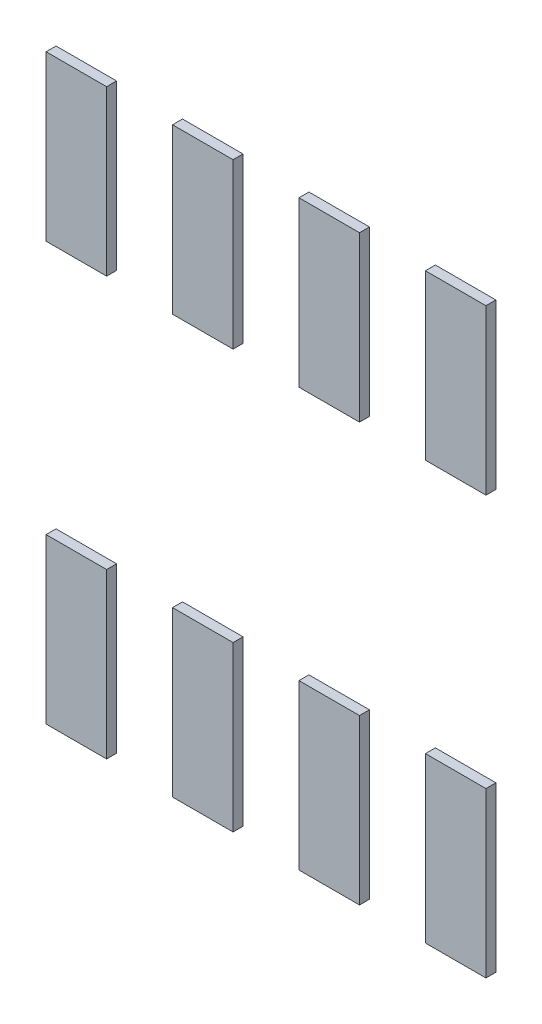
ISO-10303-21;
HEADER;
FILE_DESCRIPTION(('STEP AP214'),'2;1');
FILE_NAME('part.step','',(''),(''),'','','');
FILE_SCHEMA(('AUTOMOTIVE_DESIGN { 1 0 10303 214 1 1 1 1 }'));
ENDSEC;
DATA;
#1=APPLICATION_CONTEXT('core data for automotive mechanical design processes');
#2=APPLICATION_PROTOCOL_DEFINITION('international standard','automotive_design',2000,#1);
#3=PRODUCT_CONTEXT('',#1,'mechanical');
#4=PRODUCT('Part','Part','',(#3));
#5=PRODUCT_RELATED_PRODUCT_CATEGORY('part','',(#4));
#6=PRODUCT_DEFINITION_FORMATION('','',#4);
#7=PRODUCT_DEFINITION_CONTEXT('part definition',#1,'design');
#8=PRODUCT_DEFINITION('design','',#6,#7);
#9=PRODUCT_DEFINITION_SHAPE('','',#8);
#10=(LENGTH_UNIT() NAMED_UNIT(*) SI_UNIT(.MILLI.,.METRE.));
#11=(NAMED_UNIT(*) PLANE_ANGLE_UNIT() SI_UNIT($,.RADIAN.));
#12=(NAMED_UNIT(*) SI_UNIT($,.STERADIAN.) SOLID_ANGLE_UNIT());
#13=UNCERTAINTY_MEASURE_WITH_UNIT(LENGTH_MEASURE(1.E-05),#10,'distance_accuracy_value','');
#14=(GEOMETRIC_REPRESENTATION_CONTEXT(3) GLOBAL_UNCERTAINTY_ASSIGNED_CONTEXT((#13)) GLOBAL_UNIT_ASSIGNED_CONTEXT((#10,
#11,#12)) REPRESENTATION_CONTEXT('',''));
#15=CARTESIAN_POINT('',(0.,0.,0.));
#16=DIRECTION('',(0.,0.,1.));
#17=DIRECTION('',(1.,0.,0.));
#18=AXIS2_PLACEMENT_3D('',#15,#16,#17);
#19=CARTESIAN_POINT('',(-2.209,1.276,0.1));
#20=DIRECTION('',(0.,0.,1.));
#21=DIRECTION('',(1.,0.,0.));
#22=AXIS2_PLACEMENT_3D('',#19,#20,#21);
#23=PLANE('',#22);
#24=DIRECTION('',(0.,1.,0.));
#25=VECTOR('',#24,1.);
#26=CARTESIAN_POINT('',(-2.209,1.276,0.1));
#27=LINE('',#26,#25);
#28=CARTESIAN_POINT('',(-2.209,1.276,0.1));
#29=VERTEX_POINT('',#28);
#30=CARTESIAN_POINT('',(-2.209,2.924,0.1));
#31=VERTEX_POINT('',#30);
#32=EDGE_CURVE('P0_E88',#29,#31,#27,.T.);
#33=ORIENTED_EDGE('',*,*,#32,.F.);
#34=DIRECTION('',(1.,0.,0.));
#35=VECTOR('',#34,1.);
#36=CARTESIAN_POINT('',(-2.209,1.276,0.1));
#37=LINE('',#36,#35);
#38=CARTESIAN_POINT('',(-1.601,1.276,0.1));
#39=VERTEX_POINT('',#38);
#40=EDGE_CURVE('P0_E70',#29,#39,#37,.T.);
#41=ORIENTED_EDGE('',*,*,#40,.T.);
#42=DIRECTION('',(0.,1.,0.));
#43=VECTOR('',#42,1.);
#44=CARTESIAN_POINT('',(-1.601,1.276,0.1));
#45=LINE('',#44,#43);
#46=CARTESIAN_POINT('',(-1.601,2.924,0.1));
#47=VERTEX_POINT('',#46);
#48=EDGE_CURVE('P0_E82',#39,#47,#45,.T.);
#49=ORIENTED_EDGE('',*,*,#48,.T.);
#50=DIRECTION('',(1.,0.,0.));
#51=VECTOR('',#50,1.);
#52=CARTESIAN_POINT('',(-2.209,2.924,0.1));
#53=LINE('',#52,#51);
#54=EDGE_CURVE('P0_E11',#31,#47,#53,.T.);
#55=ORIENTED_EDGE('',*,*,#54,.F.);
#56=EDGE_LOOP('',(#33,#41,#49,#55));
#57=FACE_BOUND('',#56,.T.);
#58=ADVANCED_FACE('P0_F17',(#57),#23,.T.);
#59=CARTESIAN_POINT('',(-2.209,1.276,0.));
#60=DIRECTION('',(0.,0.,1.));
#61=DIRECTION('',(1.,0.,0.));
#62=AXIS2_PLACEMENT_3D('',#59,#60,#61);
#63=PLANE('',#62);
#64=DIRECTION('',(1.,0.,0.));
#65=VECTOR('',#64,1.);
#66=CARTESIAN_POINT('',(-2.209,2.924,0.));
#67=LINE('',#66,#65);
#68=CARTESIAN_POINT('',(-2.209,2.924,0.));
#69=VERTEX_POINT('',#68);
#70=CARTESIAN_POINT('',(-1.601,2.924,0.));
#71=VERTEX_POINT('',#70);
#72=EDGE_CURVE('P0_E25',#69,#71,#67,.T.);
#73=ORIENTED_EDGE('',*,*,#72,.T.);
#74=DIRECTION('',(0.,1.,0.));
#75=VECTOR('',#74,1.);
#76=CARTESIAN_POINT('',(-1.601,1.276,0.));
#77=LINE('',#76,#75);
#78=CARTESIAN_POINT('',(-1.601,1.276,0.));
#79=VERTEX_POINT('',#78);
#80=EDGE_CURVE('P0_E106',#79,#71,#77,.T.);
#81=ORIENTED_EDGE('',*,*,#80,.F.);
#82=DIRECTION('',(1.,0.,0.));
#83=VECTOR('',#82,1.);
#84=CARTESIAN_POINT('',(-2.209,1.276,0.));
#85=LINE('',#84,#83);
#86=CARTESIAN_POINT('',(-2.209,1.276,0.));
#87=VERTEX_POINT('',#86);
#88=EDGE_CURVE('P0_E81',#87,#79,#85,.T.);
#89=ORIENTED_EDGE('',*,*,#88,.F.);
#90=DIRECTION('',(0.,1.,0.));
#91=VECTOR('',#90,1.);
#92=CARTESIAN_POINT('',(-2.209,1.276,0.));
#93=LINE('',#92,#91);
#94=EDGE_CURVE('P0_E89',#87,#69,#93,.T.);
#95=ORIENTED_EDGE('',*,*,#94,.T.);
#96=EDGE_LOOP('',(#73,#81,#89,#95));
#97=FACE_BOUND('',#96,.T.);
#98=ADVANCED_FACE('P0_F157',(#97),#63,.F.);
#99=CARTESIAN_POINT('',(-2.209,2.924,0.));
#100=DIRECTION('',(0.,1.,0.));
#101=DIRECTION('',(1.,0.,0.));
#102=AXIS2_PLACEMENT_3D('',#99,#100,#101);
#103=PLANE('',#102);
#104=ORIENTED_EDGE('',*,*,#72,.F.);
#105=DIRECTION('',(0.,0.,1.));
#106=VECTOR('',#105,1.);
#107=CARTESIAN_POINT('',(-2.209,2.924,0.));
#108=LINE('',#107,#106);
#109=EDGE_CURVE('P0_E93',#69,#31,#108,.T.);
#110=ORIENTED_EDGE('',*,*,#109,.T.);
#111=ORIENTED_EDGE('',*,*,#54,.T.);
#112=DIRECTION('',(0.,0.,1.));
#113=VECTOR('',#112,1.);
#114=CARTESIAN_POINT('',(-1.601,2.924,0.));
#115=LINE('',#114,#113);
#116=EDGE_CURVE('P0_E102',#71,#47,#115,.T.);
#117=ORIENTED_EDGE('',*,*,#116,.F.);
#118=EDGE_LOOP('',(#104,#110,#111,#117));
#119=FACE_BOUND('',#118,.T.);
#120=ADVANCED_FACE('P0_F156',(#119),#103,.T.);
#121=CARTESIAN_POINT('',(-2.209,1.276,0.));
#122=DIRECTION('',(0.,1.,0.));
#123=DIRECTION('',(1.,0.,0.));
#124=AXIS2_PLACEMENT_3D('',#121,#122,#123);
#125=PLANE('',#124);
#126=DIRECTION('',(0.,0.,1.));
#127=VECTOR('',#126,1.);
#128=CARTESIAN_POINT('',(-1.601,1.276,0.));
#129=LINE('',#128,#127);
#130=EDGE_CURVE('P0_E76',#79,#39,#129,.T.);
#131=ORIENTED_EDGE('',*,*,#130,.T.);
#132=ORIENTED_EDGE('',*,*,#40,.F.);
#133=DIRECTION('',(0.,0.,1.));
#134=VECTOR('',#133,1.);
#135=CARTESIAN_POINT('',(-2.209,1.276,0.));
#136=LINE('',#135,#134);
#137=EDGE_CURVE('P0_E73',#87,#29,#136,.T.);
#138=ORIENTED_EDGE('',*,*,#137,.F.);
#139=ORIENTED_EDGE('',*,*,#88,.T.);
#140=EDGE_LOOP('',(#131,#132,#138,#139));
#141=FACE_BOUND('',#140,.T.);
#142=ADVANCED_FACE('P0_F72',(#141),#125,.F.);
#143=CARTESIAN_POINT('',(-1.601,1.276,0.));
#144=DIRECTION('',(1.,0.,0.));
#145=DIRECTION('',(0.,1.,0.));
#146=AXIS2_PLACEMENT_3D('',#143,#144,#145);
#147=PLANE('',#146);
#148=ORIENTED_EDGE('',*,*,#130,.F.);
#149=ORIENTED_EDGE('',*,*,#80,.T.);
#150=ORIENTED_EDGE('',*,*,#116,.T.);
#151=ORIENTED_EDGE('',*,*,#48,.F.);
#152=EDGE_LOOP('',(#148,#149,#150,#151));
#153=FACE_BOUND('',#152,.T.);
#154=ADVANCED_FACE('P0_F155',(#153),#147,.T.);
#155=CARTESIAN_POINT('',(-2.209,1.276,0.));
#156=DIRECTION('',(1.,0.,0.));
#157=DIRECTION('',(0.,1.,0.));
#158=AXIS2_PLACEMENT_3D('',#155,#156,#157);
#159=PLANE('',#158);
#160=ORIENTED_EDGE('',*,*,#32,.T.);
#161=ORIENTED_EDGE('',*,*,#109,.F.);
#162=ORIENTED_EDGE('',*,*,#94,.F.);
#163=ORIENTED_EDGE('',*,*,#137,.T.);
#164=EDGE_LOOP('',(#160,#161,#162,#163));
#165=FACE_BOUND('',#164,.T.);
#166=ADVANCED_FACE('P0_F86',(#165),#159,.F.);
#167=CLOSED_SHELL('',(#58,#98,#120,#142,#154,#166));
#168=MANIFOLD_SOLID_BREP('P0_B1',#167);
#169=CARTESIAN_POINT('',(-2.209,-2.924,0.1));
#170=DIRECTION('',(0.,0.,1.));
#171=DIRECTION('',(1.,0.,0.));
#172=AXIS2_PLACEMENT_3D('',#169,#170,#171);
#173=PLANE('',#172);
#174=DIRECTION('',(0.,1.,0.));
#175=VECTOR('',#174,1.);
#176=CARTESIAN_POINT('',(-2.209,-2.924,0.1));
#177=LINE('',#176,#175);
#178=CARTESIAN_POINT('',(-2.209,-2.924,0.1));
#179=VERTEX_POINT('',#178);
#180=CARTESIAN_POINT('',(-2.209,-1.276,0.1));
#181=VERTEX_POINT('',#180);
#182=EDGE_CURVE('P1_E88',#179,#181,#177,.T.);
#183=ORIENTED_EDGE('',*,*,#182,.F.);
#184=DIRECTION('',(1.,0.,0.));
#185=VECTOR('',#184,1.);
#186=CARTESIAN_POINT('',(-2.209,-2.924,0.1));
#187=LINE('',#186,#185);
#188=CARTESIAN_POINT('',(-1.601,-2.924,0.1));
#189=VERTEX_POINT('',#188);
#190=EDGE_CURVE('P1_E70',#179,#189,#187,.T.);
#191=ORIENTED_EDGE('',*,*,#190,.T.);
#192=DIRECTION('',(0.,1.,0.));
#193=VECTOR('',#192,1.);
#194=CARTESIAN_POINT('',(-1.601,-2.924,0.1));
#195=LINE('',#194,#193);
#196=CARTESIAN_POINT('',(-1.601,-1.276,0.1));
#197=VERTEX_POINT('',#196);
#198=EDGE_CURVE('P1_E82',#189,#197,#195,.T.);
#199=ORIENTED_EDGE('',*,*,#198,.T.);
#200=DIRECTION('',(1.,0.,0.));
#201=VECTOR('',#200,1.);
#202=CARTESIAN_POINT('',(-2.209,-1.276,0.1));
#203=LINE('',#202,#201);
#204=EDGE_CURVE('P1_E11',#181,#197,#203,.T.);
#205=ORIENTED_EDGE('',*,*,#204,.F.);
#206=EDGE_LOOP('',(#183,#191,#199,#205));
#207=FACE_BOUND('',#206,.T.);
#208=ADVANCED_FACE('P1_F17',(#207),#173,.T.);
#209=CARTESIAN_POINT('',(-2.209,-2.924,0.));
#210=DIRECTION('',(0.,0.,1.));
#211=DIRECTION('',(1.,0.,0.));
#212=AXIS2_PLACEMENT_3D('',#209,#210,#211);
#213=PLANE('',#212);
#214=DIRECTION('',(1.,0.,0.));
#215=VECTOR('',#214,1.);
#216=CARTESIAN_POINT('',(-2.209,-1.276,0.));
#217=LINE('',#216,#215);
#218=CARTESIAN_POINT('',(-2.209,-1.276,0.));
#219=VERTEX_POINT('',#218);
#220=CARTESIAN_POINT('',(-1.601,-1.276,0.));
#221=VERTEX_POINT('',#220);
#222=EDGE_CURVE('P1_E25',#219,#221,#217,.T.);
#223=ORIENTED_EDGE('',*,*,#222,.T.);
#224=DIRECTION('',(0.,1.,0.));
#225=VECTOR('',#224,1.);
#226=CARTESIAN_POINT('',(-1.601,-2.924,0.));
#227=LINE('',#226,#225);
#228=CARTESIAN_POINT('',(-1.601,-2.924,0.));
#229=VERTEX_POINT('',#228);
#230=EDGE_CURVE('P1_E105',#229,#221,#227,.T.);
#231=ORIENTED_EDGE('',*,*,#230,.F.);
#232=DIRECTION('',(1.,0.,0.));
#233=VECTOR('',#232,1.);
#234=CARTESIAN_POINT('',(-2.209,-2.924,0.));
#235=LINE('',#234,#233);
#236=CARTESIAN_POINT('',(-2.209,-2.924,0.));
#237=VERTEX_POINT('',#236);
#238=EDGE_CURVE('P1_E81',#237,#229,#235,.T.);
#239=ORIENTED_EDGE('',*,*,#238,.F.);
#240=DIRECTION('',(0.,1.,0.));
#241=VECTOR('',#240,1.);
#242=CARTESIAN_POINT('',(-2.209,-2.924,0.));
#243=LINE('',#242,#241);
#244=EDGE_CURVE('P1_E89',#237,#219,#243,.T.);
#245=ORIENTED_EDGE('',*,*,#244,.T.);
#246=EDGE_LOOP('',(#223,#231,#239,#245));
#247=FACE_BOUND('',#246,.T.);
#248=ADVANCED_FACE('P1_F119',(#247),#213,.F.);
#249=CARTESIAN_POINT('',(-2.209,-1.276,0.));
#250=DIRECTION('',(0.,1.,0.));
#251=DIRECTION('',(1.,0.,0.));
#252=AXIS2_PLACEMENT_3D('',#249,#250,#251);
#253=PLANE('',#252);
#254=ORIENTED_EDGE('',*,*,#222,.F.);
#255=DIRECTION('',(0.,0.,1.));
#256=VECTOR('',#255,1.);
#257=CARTESIAN_POINT('',(-2.209,-1.276,0.));
#258=LINE('',#257,#256);
#259=EDGE_CURVE('P1_E93',#219,#181,#258,.T.);
#260=ORIENTED_EDGE('',*,*,#259,.T.);
#261=ORIENTED_EDGE('',*,*,#204,.T.);
#262=DIRECTION('',(0.,0.,1.));
#263=VECTOR('',#262,1.);
#264=CARTESIAN_POINT('',(-1.601,-1.276,0.));
#265=LINE('',#264,#263);
#266=EDGE_CURVE('P1_E111',#221,#197,#265,.T.);
#267=ORIENTED_EDGE('',*,*,#266,.F.);
#268=EDGE_LOOP('',(#254,#260,#261,#267));
#269=FACE_BOUND('',#268,.T.);
#270=ADVANCED_FACE('P1_F122',(#269),#253,.T.);
#271=CARTESIAN_POINT('',(-2.209,-2.924,0.));
#272=DIRECTION('',(0.,1.,0.));
#273=DIRECTION('',(1.,0.,0.));
#274=AXIS2_PLACEMENT_3D('',#271,#272,#273);
#275=PLANE('',#274);
#276=DIRECTION('',(0.,0.,1.));
#277=VECTOR('',#276,1.);
#278=CARTESIAN_POINT('',(-1.601,-2.924,0.));
#279=LINE('',#278,#277);
#280=EDGE_CURVE('P1_E76',#229,#189,#279,.T.);
#281=ORIENTED_EDGE('',*,*,#280,.T.);
#282=ORIENTED_EDGE('',*,*,#190,.F.);
#283=DIRECTION('',(0.,0.,1.));
#284=VECTOR('',#283,1.);
#285=CARTESIAN_POINT('',(-2.209,-2.924,0.));
#286=LINE('',#285,#284);
#287=EDGE_CURVE('P1_E73',#237,#179,#286,.T.);
#288=ORIENTED_EDGE('',*,*,#287,.F.);
#289=ORIENTED_EDGE('',*,*,#238,.T.);
#290=EDGE_LOOP('',(#281,#282,#288,#289));
#291=FACE_BOUND('',#290,.T.);
#292=ADVANCED_FACE('P1_F72',(#291),#275,.F.);
#293=CARTESIAN_POINT('',(-1.601,-2.924,0.));
#294=DIRECTION('',(1.,0.,0.));
#295=DIRECTION('',(0.,1.,0.));
#296=AXIS2_PLACEMENT_3D('',#293,#294,#295);
#297=PLANE('',#296);
#298=ORIENTED_EDGE('',*,*,#280,.F.);
#299=ORIENTED_EDGE('',*,*,#230,.T.);
#300=ORIENTED_EDGE('',*,*,#266,.T.);
#301=ORIENTED_EDGE('',*,*,#198,.F.);
#302=EDGE_LOOP('',(#298,#299,#300,#301));
#303=FACE_BOUND('',#302,.T.);
#304=ADVANCED_FACE('P1_F121',(#303),#297,.T.);
#305=CARTESIAN_POINT('',(-2.209,-2.924,0.));
#306=DIRECTION('',(1.,0.,0.));
#307=DIRECTION('',(0.,1.,0.));
#308=AXIS2_PLACEMENT_3D('',#305,#306,#307);
#309=PLANE('',#308);
#310=ORIENTED_EDGE('',*,*,#182,.T.);
#311=ORIENTED_EDGE('',*,*,#259,.F.);
#312=ORIENTED_EDGE('',*,*,#244,.F.);
#313=ORIENTED_EDGE('',*,*,#287,.T.);
#314=EDGE_LOOP('',(#310,#311,#312,#313));
#315=FACE_BOUND('',#314,.T.);
#316=ADVANCED_FACE('P1_F86',(#315),#309,.F.);
#317=CLOSED_SHELL('',(#208,#248,#270,#292,#304,#316));
#318=MANIFOLD_SOLID_BREP('P1_B1',#317);
#319=CARTESIAN_POINT('',(-0.939,1.276,0.1));
#320=DIRECTION('',(0.,0.,1.));
#321=DIRECTION('',(1.,0.,0.));
#322=AXIS2_PLACEMENT_3D('',#319,#320,#321);
#323=PLANE('',#322);
#324=DIRECTION('',(0.,1.,0.));
#325=VECTOR('',#324,1.);
#326=CARTESIAN_POINT('',(-0.939,1.276,0.1));
#327=LINE('',#326,#325);
#328=CARTESIAN_POINT('',(-0.939,1.276,0.1));
#329=VERTEX_POINT('',#328);
#330=CARTESIAN_POINT('',(-0.939,2.924,0.1));
#331=VERTEX_POINT('',#330);
#332=EDGE_CURVE('P2_E83',#329,#331,#327,.T.);
#333=ORIENTED_EDGE('',*,*,#332,.F.);
#334=DIRECTION('',(1.,0.,0.));
#335=VECTOR('',#334,1.);
#336=CARTESIAN_POINT('',(-0.939,1.276,0.1));
#337=LINE('',#336,#335);
#338=CARTESIAN_POINT('',(-0.331,1.276,0.1));
#339=VERTEX_POINT('',#338);
#340=EDGE_CURVE('P2_E65',#329,#339,#337,.T.);
#341=ORIENTED_EDGE('',*,*,#340,.T.);
#342=DIRECTION('',(0.,1.,0.));
#343=VECTOR('',#342,1.);
#344=CARTESIAN_POINT('',(-0.331,1.276,0.1));
#345=LINE('',#344,#343);
#346=CARTESIAN_POINT('',(-0.331,2.924,0.1));
#347=VERTEX_POINT('',#346);
#348=EDGE_CURVE('P2_E77',#339,#347,#345,.T.);
#349=ORIENTED_EDGE('',*,*,#348,.T.);
#350=DIRECTION('',(1.,0.,0.));
#351=VECTOR('',#350,1.);
#352=CARTESIAN_POINT('',(-0.939,2.924,0.1));
#353=LINE('',#352,#351);
#354=EDGE_CURVE('P2_E11',#331,#347,#353,.T.);
#355=ORIENTED_EDGE('',*,*,#354,.F.);
#356=EDGE_LOOP('',(#333,#341,#349,#355));
#357=FACE_BOUND('',#356,.T.);
#358=ADVANCED_FACE('P2_F17',(#357),#323,.T.);
#359=CARTESIAN_POINT('',(-0.939,1.276,0.));
#360=DIRECTION('',(0.,0.,1.));
#361=DIRECTION('',(1.,0.,0.));
#362=AXIS2_PLACEMENT_3D('',#359,#360,#361);
#363=PLANE('',#362);
#364=DIRECTION('',(1.,0.,0.));
#365=VECTOR('',#364,1.);
#366=CARTESIAN_POINT('',(-0.939,2.924,0.));
#367=LINE('',#366,#365);
#368=CARTESIAN_POINT('',(-0.939,2.924,0.));
#369=VERTEX_POINT('',#368);
#370=CARTESIAN_POINT('',(-0.331,2.924,0.));
#371=VERTEX_POINT('',#370);
#372=EDGE_CURVE('P2_E20',#369,#371,#367,.T.);
#373=ORIENTED_EDGE('',*,*,#372,.T.);
#374=DIRECTION('',(0.,1.,0.));
#375=VECTOR('',#374,1.);
#376=CARTESIAN_POINT('',(-0.331,1.276,0.));
#377=LINE('',#376,#375);
#378=CARTESIAN_POINT('',(-0.331,1.276,0.));
#379=VERTEX_POINT('',#378);
#380=EDGE_CURVE('P2_E98',#379,#371,#377,.T.);
#381=ORIENTED_EDGE('',*,*,#380,.F.);
#382=DIRECTION('',(1.,0.,0.));
#383=VECTOR('',#382,1.);
#384=CARTESIAN_POINT('',(-0.939,1.276,0.));
#385=LINE('',#384,#383);
#386=CARTESIAN_POINT('',(-0.939,1.276,0.));
#387=VERTEX_POINT('',#386);
#388=EDGE_CURVE('P2_E76',#387,#379,#385,.T.);
#389=ORIENTED_EDGE('',*,*,#388,.F.);
#390=DIRECTION('',(0.,1.,0.));
#391=VECTOR('',#390,1.);
#392=CARTESIAN_POINT('',(-0.939,1.276,0.));
#393=LINE('',#392,#391);
#394=EDGE_CURVE('P2_E85',#387,#369,#393,.T.);
#395=ORIENTED_EDGE('',*,*,#394,.T.);
#396=EDGE_LOOP('',(#373,#381,#389,#395));
#397=FACE_BOUND('',#396,.T.);
#398=ADVANCED_FACE('P2_F118',(#397),#363,.F.);
#399=CARTESIAN_POINT('',(-0.939,2.924,0.));
#400=DIRECTION('',(0.,1.,0.));
#401=DIRECTION('',(1.,0.,0.));
#402=AXIS2_PLACEMENT_3D('',#399,#400,#401);
#403=PLANE('',#402);
#404=ORIENTED_EDGE('',*,*,#372,.F.);
#405=DIRECTION('',(0.,0.,1.));
#406=VECTOR('',#405,1.);
#407=CARTESIAN_POINT('',(-0.939,2.924,0.));
#408=LINE('',#407,#406);
#409=EDGE_CURVE('P2_E89',#369,#331,#408,.T.);
#410=ORIENTED_EDGE('',*,*,#409,.T.);
#411=ORIENTED_EDGE('',*,*,#354,.T.);
#412=DIRECTION('',(0.,0.,1.));
#413=VECTOR('',#412,1.);
#414=CARTESIAN_POINT('',(-0.331,2.924,0.));
#415=LINE('',#414,#413);
#416=EDGE_CURVE('P2_E102',#371,#347,#415,.T.);
#417=ORIENTED_EDGE('',*,*,#416,.F.);
#418=EDGE_LOOP('',(#404,#410,#411,#417));
#419=FACE_BOUND('',#418,.T.);
#420=ADVANCED_FACE('P2_F119',(#419),#403,.T.);
#421=CARTESIAN_POINT('',(-0.939,1.276,0.));
#422=DIRECTION('',(0.,1.,0.));
#423=DIRECTION('',(1.,0.,0.));
#424=AXIS2_PLACEMENT_3D('',#421,#422,#423);
#425=PLANE('',#424);
#426=DIRECTION('',(0.,0.,1.));
#427=VECTOR('',#426,1.);
#428=CARTESIAN_POINT('',(-0.331,1.276,0.));
#429=LINE('',#428,#427);
#430=EDGE_CURVE('P2_E71',#379,#339,#429,.T.);
#431=ORIENTED_EDGE('',*,*,#430,.T.);
#432=ORIENTED_EDGE('',*,*,#340,.F.);
#433=DIRECTION('',(0.,0.,1.));
#434=VECTOR('',#433,1.);
#435=CARTESIAN_POINT('',(-0.939,1.276,0.));
#436=LINE('',#435,#434);
#437=EDGE_CURVE('P2_E68',#387,#329,#436,.T.);
#438=ORIENTED_EDGE('',*,*,#437,.F.);
#439=ORIENTED_EDGE('',*,*,#388,.T.);
#440=EDGE_LOOP('',(#431,#432,#438,#439));
#441=FACE_BOUND('',#440,.T.);
#442=ADVANCED_FACE('P2_F67',(#441),#425,.F.);
#443=CARTESIAN_POINT('',(-0.331,1.276,0.));
#444=DIRECTION('',(1.,0.,0.));
#445=DIRECTION('',(0.,1.,0.));
#446=AXIS2_PLACEMENT_3D('',#443,#444,#445);
#447=PLANE('',#446);
#448=ORIENTED_EDGE('',*,*,#430,.F.);
#449=ORIENTED_EDGE('',*,*,#380,.T.);
#450=ORIENTED_EDGE('',*,*,#416,.T.);
#451=ORIENTED_EDGE('',*,*,#348,.F.);
#452=EDGE_LOOP('',(#448,#449,#450,#451));
#453=FACE_BOUND('',#452,.T.);
#454=ADVANCED_FACE('P2_F121',(#453),#447,.T.);
#455=CARTESIAN_POINT('',(-0.939,1.276,0.));
#456=DIRECTION('',(1.,0.,0.));
#457=DIRECTION('',(0.,1.,0.));
#458=AXIS2_PLACEMENT_3D('',#455,#456,#457);
#459=PLANE('',#458);
#460=ORIENTED_EDGE('',*,*,#332,.T.);
#461=ORIENTED_EDGE('',*,*,#409,.F.);
#462=ORIENTED_EDGE('',*,*,#394,.F.);
#463=ORIENTED_EDGE('',*,*,#437,.T.);
#464=EDGE_LOOP('',(#460,#461,#462,#463));
#465=FACE_BOUND('',#464,.T.);
#466=ADVANCED_FACE('P2_F81',(#465),#459,.F.);
#467=CLOSED_SHELL('',(#358,#398,#420,#442,#454,#466));
#468=MANIFOLD_SOLID_BREP('P2_B1',#467);
#469=CARTESIAN_POINT('',(-0.939,-2.924,0.1));
#470=DIRECTION('',(0.,0.,1.));
#471=DIRECTION('',(1.,0.,0.));
#472=AXIS2_PLACEMENT_3D('',#469,#470,#471);
#473=PLANE('',#472);
#474=DIRECTION('',(0.,1.,0.));
#475=VECTOR('',#474,1.);
#476=CARTESIAN_POINT('',(-0.939,-2.924,0.1));
#477=LINE('',#476,#475);
#478=CARTESIAN_POINT('',(-0.939,-2.924,0.1));
#479=VERTEX_POINT('',#478);
#480=CARTESIAN_POINT('',(-0.939,-1.276,0.1));
#481=VERTEX_POINT('',#480);
#482=EDGE_CURVE('P3_E87',#479,#481,#477,.T.);
#483=ORIENTED_EDGE('',*,*,#482,.F.);
#484=DIRECTION('',(1.,0.,0.));
#485=VECTOR('',#484,1.);
#486=CARTESIAN_POINT('',(-0.939,-2.924,0.1));
#487=LINE('',#486,#485);
#488=CARTESIAN_POINT('',(-0.331,-2.924,0.1));
#489=VERTEX_POINT('',#488);
#490=EDGE_CURVE('P3_E101',#479,#489,#487,.T.);
#491=ORIENTED_EDGE('',*,*,#490,.T.);
#492=DIRECTION('',(0.,1.,0.));
#493=VECTOR('',#492,1.);
#494=CARTESIAN_POINT('',(-0.331,-2.924,0.1));
#495=LINE('',#494,#493);
#496=CARTESIAN_POINT('',(-0.331,-1.276,0.1));
#497=VERTEX_POINT('',#496);
#498=EDGE_CURVE('P3_E110',#489,#497,#495,.T.);
#499=ORIENTED_EDGE('',*,*,#498,.T.);
#500=DIRECTION('',(1.,0.,0.));
#501=VECTOR('',#500,1.);
#502=CARTESIAN_POINT('',(-0.939,-1.276,0.1));
#503=LINE('',#502,#501);
#504=EDGE_CURVE('P3_E11',#481,#497,#503,.T.);
#505=ORIENTED_EDGE('',*,*,#504,.F.);
#506=EDGE_LOOP('',(#483,#491,#499,#505));
#507=FACE_BOUND('',#506,.T.);
#508=ADVANCED_FACE('P3_F17',(#507),#473,.T.);
#509=CARTESIAN_POINT('',(-0.939,-2.924,0.));
#510=DIRECTION('',(0.,0.,1.));
#511=DIRECTION('',(1.,0.,0.));
#512=AXIS2_PLACEMENT_3D('',#509,#510,#511);
#513=PLANE('',#512);
#514=DIRECTION('',(1.,0.,0.));
#515=VECTOR('',#514,1.);
#516=CARTESIAN_POINT('',(-0.939,-1.276,0.));
#517=LINE('',#516,#515);
#518=CARTESIAN_POINT('',(-0.939,-1.276,0.));
#519=VERTEX_POINT('',#518);
#520=CARTESIAN_POINT('',(-0.331,-1.276,0.));
#521=VERTEX_POINT('',#520);
#522=EDGE_CURVE('P3_E25',#519,#521,#517,.T.);
#523=ORIENTED_EDGE('',*,*,#522,.T.);
#524=DIRECTION('',(0.,1.,0.));
#525=VECTOR('',#524,1.);
#526=CARTESIAN_POINT('',(-0.331,-2.924,0.));
#527=LINE('',#526,#525);
#528=CARTESIAN_POINT('',(-0.331,-2.924,0.));
#529=VERTEX_POINT('',#528);
#530=EDGE_CURVE('P3_E105',#529,#521,#527,.T.);
#531=ORIENTED_EDGE('',*,*,#530,.F.);
#532=DIRECTION('',(1.,0.,0.));
#533=VECTOR('',#532,1.);
#534=CARTESIAN_POINT('',(-0.939,-2.924,0.));
#535=LINE('',#534,#533);
#536=CARTESIAN_POINT('',(-0.939,-2.924,0.));
#537=VERTEX_POINT('',#536);
#538=EDGE_CURVE('P3_E75',#537,#529,#535,.T.);
#539=ORIENTED_EDGE('',*,*,#538,.F.);
#540=DIRECTION('',(0.,1.,0.));
#541=VECTOR('',#540,1.);
#542=CARTESIAN_POINT('',(-0.939,-2.924,0.));
#543=LINE('',#542,#541);
#544=EDGE_CURVE('P3_E77',#537,#519,#543,.T.);
#545=ORIENTED_EDGE('',*,*,#544,.T.);
#546=EDGE_LOOP('',(#523,#531,#539,#545));
#547=FACE_BOUND('',#546,.T.);
#548=ADVANCED_FACE('P3_F78',(#547),#513,.F.);
#549=CARTESIAN_POINT('',(-0.939,-1.276,0.));
#550=DIRECTION('',(0.,1.,0.));
#551=DIRECTION('',(1.,0.,0.));
#552=AXIS2_PLACEMENT_3D('',#549,#550,#551);
#553=PLANE('',#552);
#554=ORIENTED_EDGE('',*,*,#522,.F.);
#555=DIRECTION('',(0.,0.,1.));
#556=VECTOR('',#555,1.);
#557=CARTESIAN_POINT('',(-0.939,-1.276,0.));
#558=LINE('',#557,#556);
#559=EDGE_CURVE('P3_E69',#519,#481,#558,.T.);
#560=ORIENTED_EDGE('',*,*,#559,.T.);
#561=ORIENTED_EDGE('',*,*,#504,.T.);
#562=DIRECTION('',(0.,0.,1.));
#563=VECTOR('',#562,1.);
#564=CARTESIAN_POINT('',(-0.331,-1.276,0.));
#565=LINE('',#564,#563);
#566=EDGE_CURVE('P3_E72',#521,#497,#565,.T.);
#567=ORIENTED_EDGE('',*,*,#566,.F.);
#568=EDGE_LOOP('',(#554,#560,#561,#567));
#569=FACE_BOUND('',#568,.T.);
#570=ADVANCED_FACE('P3_F67',(#569),#553,.T.);
#571=CARTESIAN_POINT('',(-0.939,-2.924,0.));
#572=DIRECTION('',(0.,1.,0.));
#573=DIRECTION('',(1.,0.,0.));
#574=AXIS2_PLACEMENT_3D('',#571,#572,#573);
#575=PLANE('',#574);
#576=DIRECTION('',(0.,0.,1.));
#577=VECTOR('',#576,1.);
#578=CARTESIAN_POINT('',(-0.331,-2.924,0.));
#579=LINE('',#578,#577);
#580=EDGE_CURVE('P3_E98',#529,#489,#579,.T.);
#581=ORIENTED_EDGE('',*,*,#580,.T.);
#582=ORIENTED_EDGE('',*,*,#490,.F.);
#583=DIRECTION('',(0.,0.,1.));
#584=VECTOR('',#583,1.);
#585=CARTESIAN_POINT('',(-0.939,-2.924,0.));
#586=LINE('',#585,#584);
#587=EDGE_CURVE('P3_E83',#537,#479,#586,.T.);
#588=ORIENTED_EDGE('',*,*,#587,.F.);
#589=ORIENTED_EDGE('',*,*,#538,.T.);
#590=EDGE_LOOP('',(#581,#582,#588,#589));
#591=FACE_BOUND('',#590,.T.);
#592=ADVANCED_FACE('P3_F122',(#591),#575,.F.);
#593=CARTESIAN_POINT('',(-0.331,-2.924,0.));
#594=DIRECTION('',(1.,0.,0.));
#595=DIRECTION('',(0.,1.,0.));
#596=AXIS2_PLACEMENT_3D('',#593,#594,#595);
#597=PLANE('',#596);
#598=ORIENTED_EDGE('',*,*,#580,.F.);
#599=ORIENTED_EDGE('',*,*,#530,.T.);
#600=ORIENTED_EDGE('',*,*,#566,.T.);
#601=ORIENTED_EDGE('',*,*,#498,.F.);
#602=EDGE_LOOP('',(#598,#599,#600,#601));
#603=FACE_BOUND('',#602,.T.);
#604=ADVANCED_FACE('P3_F120',(#603),#597,.T.);
#605=CARTESIAN_POINT('',(-0.939,-2.924,0.));
#606=DIRECTION('',(1.,0.,0.));
#607=DIRECTION('',(0.,1.,0.));
#608=AXIS2_PLACEMENT_3D('',#605,#606,#607);
#609=PLANE('',#608);
#610=ORIENTED_EDGE('',*,*,#482,.T.);
#611=ORIENTED_EDGE('',*,*,#559,.F.);
#612=ORIENTED_EDGE('',*,*,#544,.F.);
#613=ORIENTED_EDGE('',*,*,#587,.T.);
#614=EDGE_LOOP('',(#610,#611,#612,#613));
#615=FACE_BOUND('',#614,.T.);
#616=ADVANCED_FACE('P3_F85',(#615),#609,.F.);
#617=CLOSED_SHELL('',(#508,#548,#570,#592,#604,#616));
#618=MANIFOLD_SOLID_BREP('P3_B1',#617);
#619=CARTESIAN_POINT('',(0.331,1.276,0.1));
#620=DIRECTION('',(0.,0.,1.));
#621=DIRECTION('',(1.,0.,0.));
#622=AXIS2_PLACEMENT_3D('',#619,#620,#621);
#623=PLANE('',#622);
#624=DIRECTION('',(0.,1.,0.));
#625=VECTOR('',#624,1.);
#626=CARTESIAN_POINT('',(0.331,1.276,0.1));
#627=LINE('',#626,#625);
#628=CARTESIAN_POINT('',(0.331,1.276,0.1));
#629=VERTEX_POINT('',#628);
#630=CARTESIAN_POINT('',(0.331,2.924,0.1));
#631=VERTEX_POINT('',#630);
#632=EDGE_CURVE('P4_E83',#629,#631,#627,.T.);
#633=ORIENTED_EDGE('',*,*,#632,.F.);
#634=DIRECTION('',(1.,0.,0.));
#635=VECTOR('',#634,1.);
#636=CARTESIAN_POINT('',(0.331,1.276,0.1));
#637=LINE('',#636,#635);
#638=CARTESIAN_POINT('',(0.939,1.276,0.1));
#639=VERTEX_POINT('',#638);
#640=EDGE_CURVE('P4_E65',#629,#639,#637,.T.);
#641=ORIENTED_EDGE('',*,*,#640,.T.);
#642=DIRECTION('',(0.,1.,0.));
#643=VECTOR('',#642,1.);
#644=CARTESIAN_POINT('',(0.939,1.276,0.1));
#645=LINE('',#644,#643);
#646=CARTESIAN_POINT('',(0.939,2.924,0.1));
#647=VERTEX_POINT('',#646);
#648=EDGE_CURVE('P4_E77',#639,#647,#645,.T.);
#649=ORIENTED_EDGE('',*,*,#648,.T.);
#650=DIRECTION('',(1.,0.,0.));
#651=VECTOR('',#650,1.);
#652=CARTESIAN_POINT('',(0.331,2.924,0.1));
#653=LINE('',#652,#651);
#654=EDGE_CURVE('P4_E11',#631,#647,#653,.T.);
#655=ORIENTED_EDGE('',*,*,#654,.F.);
#656=EDGE_LOOP('',(#633,#641,#649,#655));
#657=FACE_BOUND('',#656,.T.);
#658=ADVANCED_FACE('P4_F17',(#657),#623,.T.);
#659=CARTESIAN_POINT('',(0.331,1.276,0.));
#660=DIRECTION('',(0.,0.,1.));
#661=DIRECTION('',(1.,0.,0.));
#662=AXIS2_PLACEMENT_3D('',#659,#660,#661);
#663=PLANE('',#662);
#664=DIRECTION('',(1.,0.,0.));
#665=VECTOR('',#664,1.);
#666=CARTESIAN_POINT('',(0.331,2.924,0.));
#667=LINE('',#666,#665);
#668=CARTESIAN_POINT('',(0.331,2.924,0.));
#669=VERTEX_POINT('',#668);
#670=CARTESIAN_POINT('',(0.939,2.924,0.));
#671=VERTEX_POINT('',#670);
#672=EDGE_CURVE('P4_E26',#669,#671,#667,.T.);
#673=ORIENTED_EDGE('',*,*,#672,.T.);
#674=DIRECTION('',(0.,1.,0.));
#675=VECTOR('',#674,1.);
#676=CARTESIAN_POINT('',(0.939,1.276,0.));
#677=LINE('',#676,#675);
#678=CARTESIAN_POINT('',(0.939,1.276,0.));
#679=VERTEX_POINT('',#678);
#680=EDGE_CURVE('P4_E101',#679,#671,#677,.T.);
#681=ORIENTED_EDGE('',*,*,#680,.F.);
#682=DIRECTION('',(1.,0.,0.));
#683=VECTOR('',#682,1.);
#684=CARTESIAN_POINT('',(0.331,1.276,0.));
#685=LINE('',#684,#683);
#686=CARTESIAN_POINT('',(0.331,1.276,0.));
#687=VERTEX_POINT('',#686);
#688=EDGE_CURVE('P4_E76',#687,#679,#685,.T.);
#689=ORIENTED_EDGE('',*,*,#688,.F.);
#690=DIRECTION('',(0.,1.,0.));
#691=VECTOR('',#690,1.);
#692=CARTESIAN_POINT('',(0.331,1.276,0.));
#693=LINE('',#692,#691);
#694=EDGE_CURVE('P4_E85',#687,#669,#693,.T.);
#695=ORIENTED_EDGE('',*,*,#694,.T.);
#696=EDGE_LOOP('',(#673,#681,#689,#695));
#697=FACE_BOUND('',#696,.T.);
#698=ADVANCED_FACE('P4_F116',(#697),#663,.F.);
#699=CARTESIAN_POINT('',(0.331,2.924,0.));
#700=DIRECTION('',(0.,1.,0.));
#701=DIRECTION('',(1.,0.,0.));
#702=AXIS2_PLACEMENT_3D('',#699,#700,#701);
#703=PLANE('',#702);
#704=ORIENTED_EDGE('',*,*,#672,.F.);
#705=DIRECTION('',(0.,0.,1.));
#706=VECTOR('',#705,1.);
#707=CARTESIAN_POINT('',(0.331,2.924,0.));
#708=LINE('',#707,#706);
#709=EDGE_CURVE('P4_E89',#669,#631,#708,.T.);
#710=ORIENTED_EDGE('',*,*,#709,.T.);
#711=ORIENTED_EDGE('',*,*,#654,.T.);
#712=DIRECTION('',(0.,0.,1.));
#713=VECTOR('',#712,1.);
#714=CARTESIAN_POINT('',(0.939,2.924,0.));
#715=LINE('',#714,#713);
#716=EDGE_CURVE('P4_E106',#671,#647,#715,.T.);
#717=ORIENTED_EDGE('',*,*,#716,.F.);
#718=EDGE_LOOP('',(#704,#710,#711,#717));
#719=FACE_BOUND('',#718,.T.);
#720=ADVANCED_FACE('P4_F117',(#719),#703,.T.);
#721=CARTESIAN_POINT('',(0.331,1.276,0.));
#722=DIRECTION('',(0.,1.,0.));
#723=DIRECTION('',(1.,0.,0.));
#724=AXIS2_PLACEMENT_3D('',#721,#722,#723);
#725=PLANE('',#724);
#726=DIRECTION('',(0.,0.,1.));
#727=VECTOR('',#726,1.);
#728=CARTESIAN_POINT('',(0.939,1.276,0.));
#729=LINE('',#728,#727);
#730=EDGE_CURVE('P4_E71',#679,#639,#729,.T.);
#731=ORIENTED_EDGE('',*,*,#730,.T.);
#732=ORIENTED_EDGE('',*,*,#640,.F.);
#733=DIRECTION('',(0.,0.,1.));
#734=VECTOR('',#733,1.);
#735=CARTESIAN_POINT('',(0.331,1.276,0.));
#736=LINE('',#735,#734);
#737=EDGE_CURVE('P4_E68',#687,#629,#736,.T.);
#738=ORIENTED_EDGE('',*,*,#737,.F.);
#739=ORIENTED_EDGE('',*,*,#688,.T.);
#740=EDGE_LOOP('',(#731,#732,#738,#739));
#741=FACE_BOUND('',#740,.T.);
#742=ADVANCED_FACE('P4_F67',(#741),#725,.F.);
#743=CARTESIAN_POINT('',(0.939,1.276,0.));
#744=DIRECTION('',(1.,0.,0.));
#745=DIRECTION('',(0.,1.,0.));
#746=AXIS2_PLACEMENT_3D('',#743,#744,#745);
#747=PLANE('',#746);
#748=ORIENTED_EDGE('',*,*,#730,.F.);
#749=ORIENTED_EDGE('',*,*,#680,.T.);
#750=ORIENTED_EDGE('',*,*,#716,.T.);
#751=ORIENTED_EDGE('',*,*,#648,.F.);
#752=EDGE_LOOP('',(#748,#749,#750,#751));
#753=FACE_BOUND('',#752,.T.);
#754=ADVANCED_FACE('P4_F119',(#753),#747,.T.);
#755=CARTESIAN_POINT('',(0.331,1.276,0.));
#756=DIRECTION('',(1.,0.,0.));
#757=DIRECTION('',(0.,1.,0.));
#758=AXIS2_PLACEMENT_3D('',#755,#756,#757);
#759=PLANE('',#758);
#760=ORIENTED_EDGE('',*,*,#632,.T.);
#761=ORIENTED_EDGE('',*,*,#709,.F.);
#762=ORIENTED_EDGE('',*,*,#694,.F.);
#763=ORIENTED_EDGE('',*,*,#737,.T.);
#764=EDGE_LOOP('',(#760,#761,#762,#763));
#765=FACE_BOUND('',#764,.T.);
#766=ADVANCED_FACE('P4_F81',(#765),#759,.F.);
#767=CLOSED_SHELL('',(#658,#698,#720,#742,#754,#766));
#768=MANIFOLD_SOLID_BREP('P4_B1',#767);
#769=CARTESIAN_POINT('',(0.331,-2.924,0.1));
#770=DIRECTION('',(0.,0.,1.));
#771=DIRECTION('',(1.,0.,0.));
#772=AXIS2_PLACEMENT_3D('',#769,#770,#771);
#773=PLANE('',#772);
#774=DIRECTION('',(0.,1.,0.));
#775=VECTOR('',#774,1.);
#776=CARTESIAN_POINT('',(0.331,-2.924,0.1));
#777=LINE('',#776,#775);
#778=CARTESIAN_POINT('',(0.331,-2.924,0.1));
#779=VERTEX_POINT('',#778);
#780=CARTESIAN_POINT('',(0.331,-1.276,0.1));
#781=VERTEX_POINT('',#780);
#782=EDGE_CURVE('P5_E74',#779,#781,#777,.T.);
#783=ORIENTED_EDGE('',*,*,#782,.F.);
#784=DIRECTION('',(1.,0.,0.));
#785=VECTOR('',#784,1.);
#786=CARTESIAN_POINT('',(0.331,-2.924,0.1));
#787=LINE('',#786,#785);
#788=CARTESIAN_POINT('',(0.939,-2.924,0.1));
#789=VERTEX_POINT('',#788);
#790=EDGE_CURVE('P5_E68',#779,#789,#787,.T.);
#791=ORIENTED_EDGE('',*,*,#790,.T.);
#792=DIRECTION('',(0.,1.,0.));
#793=VECTOR('',#792,1.);
#794=CARTESIAN_POINT('',(0.939,-2.924,0.1));
#795=LINE('',#794,#793);
#796=CARTESIAN_POINT('',(0.939,-1.276,0.1));
#797=VERTEX_POINT('',#796);
#798=EDGE_CURVE('P5_E70',#789,#797,#795,.T.);
#799=ORIENTED_EDGE('',*,*,#798,.T.);
#800=DIRECTION('',(1.,0.,0.));
#801=VECTOR('',#800,1.);
#802=CARTESIAN_POINT('',(0.331,-1.276,0.1));
#803=LINE('',#802,#801);
#804=EDGE_CURVE('P5_E11',#781,#797,#803,.T.);
#805=ORIENTED_EDGE('',*,*,#804,.F.);
#806=EDGE_LOOP('',(#783,#791,#799,#805));
#807=FACE_BOUND('',#806,.T.);
#808=ADVANCED_FACE('P5_F17',(#807),#773,.T.);
#809=CARTESIAN_POINT('',(0.331,-2.924,0.));
#810=DIRECTION('',(0.,0.,1.));
#811=DIRECTION('',(1.,0.,0.));
#812=AXIS2_PLACEMENT_3D('',#809,#810,#811);
#813=PLANE('',#812);
#814=DIRECTION('',(1.,0.,0.));
#815=VECTOR('',#814,1.);
#816=CARTESIAN_POINT('',(0.331,-1.276,0.));
#817=LINE('',#816,#815);
#818=CARTESIAN_POINT('',(0.331,-1.276,0.));
#819=VERTEX_POINT('',#818);
#820=CARTESIAN_POINT('',(0.939,-1.276,0.));
#821=VERTEX_POINT('',#820);
#822=EDGE_CURVE('P5_E26',#819,#821,#817,.T.);
#823=ORIENTED_EDGE('',*,*,#822,.T.);
#824=DIRECTION('',(0.,1.,0.));
#825=VECTOR('',#824,1.);
#826=CARTESIAN_POINT('',(0.939,-2.924,0.));
#827=LINE('',#826,#825);
#828=CARTESIAN_POINT('',(0.939,-2.924,0.));
#829=VERTEX_POINT('',#828);
#830=EDGE_CURVE('P5_E88',#829,#821,#827,.T.);
#831=ORIENTED_EDGE('',*,*,#830,.F.);
#832=DIRECTION('',(1.,0.,0.));
#833=VECTOR('',#832,1.);
#834=CARTESIAN_POINT('',(0.331,-2.924,0.));
#835=LINE('',#834,#833);
#836=CARTESIAN_POINT('',(0.331,-2.924,0.));
#837=VERTEX_POINT('',#836);
#838=EDGE_CURVE('P5_E60',#837,#829,#835,.T.);
#839=ORIENTED_EDGE('',*,*,#838,.F.);
#840=DIRECTION('',(0.,1.,0.));
#841=VECTOR('',#840,1.);
#842=CARTESIAN_POINT('',(0.331,-2.924,0.));
#843=LINE('',#842,#841);
#844=EDGE_CURVE('P5_E97',#837,#819,#843,.T.);
#845=ORIENTED_EDGE('',*,*,#844,.T.);
#846=EDGE_LOOP('',(#823,#831,#839,#845));
#847=FACE_BOUND('',#846,.T.);
#848=ADVANCED_FACE('P5_F133',(#847),#813,.F.);
#849=CARTESIAN_POINT('',(0.331,-1.276,0.));
#850=DIRECTION('',(0.,1.,0.));
#851=DIRECTION('',(1.,0.,0.));
#852=AXIS2_PLACEMENT_3D('',#849,#850,#851);
#853=PLANE('',#852);
#854=ORIENTED_EDGE('',*,*,#822,.F.);
#855=DIRECTION('',(0.,0.,1.));
#856=VECTOR('',#855,1.);
#857=CARTESIAN_POINT('',(0.331,-1.276,0.));
#858=LINE('',#857,#856);
#859=EDGE_CURVE('P5_E113',#819,#781,#858,.T.);
#860=ORIENTED_EDGE('',*,*,#859,.T.);
#861=ORIENTED_EDGE('',*,*,#804,.T.);
#862=DIRECTION('',(0.,0.,1.));
#863=VECTOR('',#862,1.);
#864=CARTESIAN_POINT('',(0.939,-1.276,0.));
#865=LINE('',#864,#863);
#866=EDGE_CURVE('P5_E83',#821,#797,#865,.T.);
#867=ORIENTED_EDGE('',*,*,#866,.F.);
#868=EDGE_LOOP('',(#854,#860,#861,#867));
#869=FACE_BOUND('',#868,.T.);
#870=ADVANCED_FACE('P5_F140',(#869),#853,.T.);
#871=CARTESIAN_POINT('',(0.331,-2.924,0.));
#872=DIRECTION('',(0.,1.,0.));
#873=DIRECTION('',(1.,0.,0.));
#874=AXIS2_PLACEMENT_3D('',#871,#872,#873);
#875=PLANE('',#874);
#876=DIRECTION('',(0.,0.,1.));
#877=VECTOR('',#876,1.);
#878=CARTESIAN_POINT('',(0.939,-2.924,0.));
#879=LINE('',#878,#877);
#880=EDGE_CURVE('P5_E82',#829,#789,#879,.T.);
#881=ORIENTED_EDGE('',*,*,#880,.T.);
#882=ORIENTED_EDGE('',*,*,#790,.F.);
#883=DIRECTION('',(0.,0.,1.));
#884=VECTOR('',#883,1.);
#885=CARTESIAN_POINT('',(0.331,-2.924,0.));
#886=LINE('',#885,#884);
#887=EDGE_CURVE('P5_E89',#837,#779,#886,.T.);
#888=ORIENTED_EDGE('',*,*,#887,.F.);
#889=ORIENTED_EDGE('',*,*,#838,.T.);
#890=EDGE_LOOP('',(#881,#882,#888,#889));
#891=FACE_BOUND('',#890,.T.);
#892=ADVANCED_FACE('P5_F86',(#891),#875,.F.);
#893=CARTESIAN_POINT('',(0.939,-2.924,0.));
#894=DIRECTION('',(1.,0.,0.));
#895=DIRECTION('',(0.,1.,0.));
#896=AXIS2_PLACEMENT_3D('',#893,#894,#895);
#897=PLANE('',#896);
#898=ORIENTED_EDGE('',*,*,#880,.F.);
#899=ORIENTED_EDGE('',*,*,#830,.T.);
#900=ORIENTED_EDGE('',*,*,#866,.T.);
#901=ORIENTED_EDGE('',*,*,#798,.F.);
#902=EDGE_LOOP('',(#898,#899,#900,#901));
#903=FACE_BOUND('',#902,.T.);
#904=ADVANCED_FACE('P5_F80',(#903),#897,.T.);
#905=CARTESIAN_POINT('',(0.331,-2.924,0.));
#906=DIRECTION('',(1.,0.,0.));
#907=DIRECTION('',(0.,1.,0.));
#908=AXIS2_PLACEMENT_3D('',#905,#906,#907);
#909=PLANE('',#908);
#910=ORIENTED_EDGE('',*,*,#782,.T.);
#911=ORIENTED_EDGE('',*,*,#859,.F.);
#912=ORIENTED_EDGE('',*,*,#844,.F.);
#913=ORIENTED_EDGE('',*,*,#887,.T.);
#914=EDGE_LOOP('',(#910,#911,#912,#913));
#915=FACE_BOUND('',#914,.T.);
#916=ADVANCED_FACE('P5_F121',(#915),#909,.F.);
#917=CLOSED_SHELL('',(#808,#848,#870,#892,#904,#916));
#918=MANIFOLD_SOLID_BREP('P5_B1',#917);
#919=CARTESIAN_POINT('',(1.601,1.276,0.1));
#920=DIRECTION('',(0.,0.,1.));
#921=DIRECTION('',(1.,0.,0.));
#922=AXIS2_PLACEMENT_3D('',#919,#920,#921);
#923=PLANE('',#922);
#924=DIRECTION('',(0.,1.,0.));
#925=VECTOR('',#924,1.);
#926=CARTESIAN_POINT('',(1.601,1.276,0.1));
#927=LINE('',#926,#925);
#928=CARTESIAN_POINT('',(1.601,1.276,0.1));
#929=VERTEX_POINT('',#928);
#930=CARTESIAN_POINT('',(1.601,2.924,0.1));
#931=VERTEX_POINT('',#930);
#932=EDGE_CURVE('P6_E88',#929,#931,#927,.T.);
#933=ORIENTED_EDGE('',*,*,#932,.F.);
#934=DIRECTION('',(1.,0.,0.));
#935=VECTOR('',#934,1.);
#936=CARTESIAN_POINT('',(1.601,1.276,0.1));
#937=LINE('',#936,#935);
#938=CARTESIAN_POINT('',(2.209,1.276,0.1));
#939=VERTEX_POINT('',#938);
#940=EDGE_CURVE('P6_E70',#929,#939,#937,.T.);
#941=ORIENTED_EDGE('',*,*,#940,.T.);
#942=DIRECTION('',(0.,1.,0.));
#943=VECTOR('',#942,1.);
#944=CARTESIAN_POINT('',(2.209,1.276,0.1));
#945=LINE('',#944,#943);
#946=CARTESIAN_POINT('',(2.209,2.924,0.1));
#947=VERTEX_POINT('',#946);
#948=EDGE_CURVE('P6_E82',#939,#947,#945,.T.);
#949=ORIENTED_EDGE('',*,*,#948,.T.);
#950=DIRECTION('',(1.,0.,0.));
#951=VECTOR('',#950,1.);
#952=CARTESIAN_POINT('',(1.601,2.924,0.1));
#953=LINE('',#952,#951);
#954=EDGE_CURVE('P6_E11',#931,#947,#953,.T.);
#955=ORIENTED_EDGE('',*,*,#954,.F.);
#956=EDGE_LOOP('',(#933,#941,#949,#955));
#957=FACE_BOUND('',#956,.T.);
#958=ADVANCED_FACE('P6_F17',(#957),#923,.T.);
#959=CARTESIAN_POINT('',(1.601,1.276,0.));
#960=DIRECTION('',(0.,0.,1.));
#961=DIRECTION('',(1.,0.,0.));
#962=AXIS2_PLACEMENT_3D('',#959,#960,#961);
#963=PLANE('',#962);
#964=DIRECTION('',(1.,0.,0.));
#965=VECTOR('',#964,1.);
#966=CARTESIAN_POINT('',(1.601,2.924,0.));
#967=LINE('',#966,#965);
#968=CARTESIAN_POINT('',(1.601,2.924,0.));
#969=VERTEX_POINT('',#968);
#970=CARTESIAN_POINT('',(2.209,2.924,0.));
#971=VERTEX_POINT('',#970);
#972=EDGE_CURVE('P6_E25',#969,#971,#967,.T.);
#973=ORIENTED_EDGE('',*,*,#972,.T.);
#974=DIRECTION('',(0.,1.,0.));
#975=VECTOR('',#974,1.);
#976=CARTESIAN_POINT('',(2.209,1.276,0.));
#977=LINE('',#976,#975);
#978=CARTESIAN_POINT('',(2.209,1.276,0.));
#979=VERTEX_POINT('',#978);
#980=EDGE_CURVE('P6_E106',#979,#971,#977,.T.);
#981=ORIENTED_EDGE('',*,*,#980,.F.);
#982=DIRECTION('',(1.,0.,0.));
#983=VECTOR('',#982,1.);
#984=CARTESIAN_POINT('',(1.601,1.276,0.));
#985=LINE('',#984,#983);
#986=CARTESIAN_POINT('',(1.601,1.276,0.));
#987=VERTEX_POINT('',#986);
#988=EDGE_CURVE('P6_E81',#987,#979,#985,.T.);
#989=ORIENTED_EDGE('',*,*,#988,.F.);
#990=DIRECTION('',(0.,1.,0.));
#991=VECTOR('',#990,1.);
#992=CARTESIAN_POINT('',(1.601,1.276,0.));
#993=LINE('',#992,#991);
#994=EDGE_CURVE('P6_E89',#987,#969,#993,.T.);
#995=ORIENTED_EDGE('',*,*,#994,.T.);
#996=EDGE_LOOP('',(#973,#981,#989,#995));
#997=FACE_BOUND('',#996,.T.);
#998=ADVANCED_FACE('P6_F191',(#997),#963,.F.);
#999=CARTESIAN_POINT('',(1.601,2.924,0.));
#1000=DIRECTION('',(0.,1.,0.));
#1001=DIRECTION('',(1.,0.,0.));
#1002=AXIS2_PLACEMENT_3D('',#999,#1000,#1001);
#1003=PLANE('',#1002);
#1004=ORIENTED_EDGE('',*,*,#972,.F.);
#1005=DIRECTION('',(0.,0.,1.));
#1006=VECTOR('',#1005,1.);
#1007=CARTESIAN_POINT('',(1.601,2.924,0.));
#1008=LINE('',#1007,#1006);
#1009=EDGE_CURVE('P6_E93',#969,#931,#1008,.T.);
#1010=ORIENTED_EDGE('',*,*,#1009,.T.);
#1011=ORIENTED_EDGE('',*,*,#954,.T.);
#1012=DIRECTION('',(0.,0.,1.));
#1013=VECTOR('',#1012,1.);
#1014=CARTESIAN_POINT('',(2.209,2.924,0.));
#1015=LINE('',#1014,#1013);
#1016=EDGE_CURVE('P6_E103',#971,#947,#1015,.T.);
#1017=ORIENTED_EDGE('',*,*,#1016,.F.);
#1018=EDGE_LOOP('',(#1004,#1010,#1011,#1017));
#1019=FACE_BOUND('',#1018,.T.);
#1020=ADVANCED_FACE('P6_F181',(#1019),#1003,.T.);
#1021=CARTESIAN_POINT('',(1.601,1.276,0.));
#1022=DIRECTION('',(0.,1.,0.));
#1023=DIRECTION('',(1.,0.,0.));
#1024=AXIS2_PLACEMENT_3D('',#1021,#1022,#1023);
#1025=PLANE('',#1024);
#1026=DIRECTION('',(0.,0.,1.));
#1027=VECTOR('',#1026,1.);
#1028=CARTESIAN_POINT('',(2.209,1.276,0.));
#1029=LINE('',#1028,#1027);
#1030=EDGE_CURVE('P6_E76',#979,#939,#1029,.T.);
#1031=ORIENTED_EDGE('',*,*,#1030,.T.);
#1032=ORIENTED_EDGE('',*,*,#940,.F.);
#1033=DIRECTION('',(0.,0.,1.));
#1034=VECTOR('',#1033,1.);
#1035=CARTESIAN_POINT('',(1.601,1.276,0.));
#1036=LINE('',#1035,#1034);
#1037=EDGE_CURVE('P6_E73',#987,#929,#1036,.T.);
#1038=ORIENTED_EDGE('',*,*,#1037,.F.);
#1039=ORIENTED_EDGE('',*,*,#988,.T.);
#1040=EDGE_LOOP('',(#1031,#1032,#1038,#1039));
#1041=FACE_BOUND('',#1040,.T.);
#1042=ADVANCED_FACE('P6_F72',(#1041),#1025,.F.);
#1043=CARTESIAN_POINT('',(2.209,1.276,0.));
#1044=DIRECTION('',(1.,0.,0.));
#1045=DIRECTION('',(0.,1.,0.));
#1046=AXIS2_PLACEMENT_3D('',#1043,#1044,#1045);
#1047=PLANE('',#1046);
#1048=ORIENTED_EDGE('',*,*,#1030,.F.);
#1049=ORIENTED_EDGE('',*,*,#980,.T.);
#1050=ORIENTED_EDGE('',*,*,#1016,.T.);
#1051=ORIENTED_EDGE('',*,*,#948,.F.);
#1052=EDGE_LOOP('',(#1048,#1049,#1050,#1051));
#1053=FACE_BOUND('',#1052,.T.);
#1054=ADVANCED_FACE('P6_F160',(#1053),#1047,.T.);
#1055=CARTESIAN_POINT('',(1.601,1.276,0.));
#1056=DIRECTION('',(1.,0.,0.));
#1057=DIRECTION('',(0.,1.,0.));
#1058=AXIS2_PLACEMENT_3D('',#1055,#1056,#1057);
#1059=PLANE('',#1058);
#1060=ORIENTED_EDGE('',*,*,#932,.T.);
#1061=ORIENTED_EDGE('',*,*,#1009,.F.);
#1062=ORIENTED_EDGE('',*,*,#994,.F.);
#1063=ORIENTED_EDGE('',*,*,#1037,.T.);
#1064=EDGE_LOOP('',(#1060,#1061,#1062,#1063));
#1065=FACE_BOUND('',#1064,.T.);
#1066=ADVANCED_FACE('P6_F86',(#1065),#1059,.F.);
#1067=CLOSED_SHELL('',(#958,#998,#1020,#1042,#1054,#1066));
#1068=MANIFOLD_SOLID_BREP('P6_B1',#1067);
#1069=CARTESIAN_POINT('',(1.601,-2.924,0.1));
#1070=DIRECTION('',(0.,0.,1.));
#1071=DIRECTION('',(1.,0.,0.));
#1072=AXIS2_PLACEMENT_3D('',#1069,#1070,#1071);
#1073=PLANE('',#1072);
#1074=DIRECTION('',(0.,1.,0.));
#1075=VECTOR('',#1074,1.);
#1076=CARTESIAN_POINT('',(1.601,-2.924,0.1));
#1077=LINE('',#1076,#1075);
#1078=CARTESIAN_POINT('',(1.601,-2.924,0.1));
#1079=VERTEX_POINT('',#1078);
#1080=CARTESIAN_POINT('',(1.601,-1.276,0.1));
#1081=VERTEX_POINT('',#1080);
#1082=EDGE_CURVE('P7_E69',#1079,#1081,#1077,.T.);
#1083=ORIENTED_EDGE('',*,*,#1082,.F.);
#1084=DIRECTION('',(1.,0.,0.));
#1085=VECTOR('',#1084,1.);
#1086=CARTESIAN_POINT('',(1.601,-2.924,0.1));
#1087=LINE('',#1086,#1085);
#1088=CARTESIAN_POINT('',(2.209,-2.924,0.1));
#1089=VERTEX_POINT('',#1088);
#1090=EDGE_CURVE('P7_E64',#1079,#1089,#1087,.T.);
#1091=ORIENTED_EDGE('',*,*,#1090,.T.);
#1092=DIRECTION('',(0.,1.,0.));
#1093=VECTOR('',#1092,1.);
#1094=CARTESIAN_POINT('',(2.209,-2.924,0.1));
#1095=LINE('',#1094,#1093);
#1096=CARTESIAN_POINT('',(2.209,-1.276,0.1));
#1097=VERTEX_POINT('',#1096);
#1098=EDGE_CURVE('P7_E66',#1089,#1097,#1095,.T.);
#1099=ORIENTED_EDGE('',*,*,#1098,.T.);
#1100=DIRECTION('',(1.,0.,0.));
#1101=VECTOR('',#1100,1.);
#1102=CARTESIAN_POINT('',(1.601,-1.276,0.1));
#1103=LINE('',#1102,#1101);
#1104=EDGE_CURVE('P7_E11',#1081,#1097,#1103,.T.);
#1105=ORIENTED_EDGE('',*,*,#1104,.F.);
#1106=EDGE_LOOP('',(#1083,#1091,#1099,#1105));
#1107=FACE_BOUND('',#1106,.T.);
#1108=ADVANCED_FACE('P7_F17',(#1107),#1073,.T.);
#1109=CARTESIAN_POINT('',(1.601,-2.924,0.));
#1110=DIRECTION('',(0.,0.,1.));
#1111=DIRECTION('',(1.,0.,0.));
#1112=AXIS2_PLACEMENT_3D('',#1109,#1110,#1111);
#1113=PLANE('',#1112);
#1114=DIRECTION('',(1.,0.,0.));
#1115=VECTOR('',#1114,1.);
#1116=CARTESIAN_POINT('',(1.601,-1.276,0.));
#1117=LINE('',#1116,#1115);
#1118=CARTESIAN_POINT('',(1.601,-1.276,0.));
#1119=VERTEX_POINT('',#1118);
#1120=CARTESIAN_POINT('',(2.209,-1.276,0.));
#1121=VERTEX_POINT('',#1120);
#1122=EDGE_CURVE('P7_E28',#1119,#1121,#1117,.T.);
#1123=ORIENTED_EDGE('',*,*,#1122,.T.);
#1124=DIRECTION('',(0.,1.,0.));
#1125=VECTOR('',#1124,1.);
#1126=CARTESIAN_POINT('',(2.209,-2.924,0.));
#1127=LINE('',#1126,#1125);
#1128=CARTESIAN_POINT('',(2.209,-2.924,0.));
#1129=VERTEX_POINT('',#1128);
#1130=EDGE_CURVE('P7_E88',#1129,#1121,#1127,.T.);
#1131=ORIENTED_EDGE('',*,*,#1130,.F.);
#1132=DIRECTION('',(1.,0.,0.));
#1133=VECTOR('',#1132,1.);
#1134=CARTESIAN_POINT('',(1.601,-2.924,0.));
#1135=LINE('',#1134,#1133);
#1136=CARTESIAN_POINT('',(1.601,-2.924,0.));
#1137=VERTEX_POINT('',#1136);
#1138=EDGE_CURVE('P7_E21',#1137,#1129,#1135,.T.);
#1139=ORIENTED_EDGE('',*,*,#1138,.F.);
#1140=DIRECTION('',(0.,1.,0.));
#1141=VECTOR('',#1140,1.);
#1142=CARTESIAN_POINT('',(1.601,-2.924,0.));
#1143=LINE('',#1142,#1141);
#1144=EDGE_CURVE('P7_E97',#1137,#1119,#1143,.T.);
#1145=ORIENTED_EDGE('',*,*,#1144,.T.);
#1146=EDGE_LOOP('',(#1123,#1131,#1139,#1145));
#1147=FACE_BOUND('',#1146,.T.);
#1148=ADVANCED_FACE('P7_F19',(#1147),#1113,.F.);
#1149=CARTESIAN_POINT('',(1.601,-1.276,0.));
#1150=DIRECTION('',(0.,1.,0.));
#1151=DIRECTION('',(1.,0.,0.));
#1152=AXIS2_PLACEMENT_3D('',#1149,#1150,#1151);
#1153=PLANE('',#1152);
#1154=ORIENTED_EDGE('',*,*,#1122,.F.);
#1155=DIRECTION('',(0.,0.,1.));
#1156=VECTOR('',#1155,1.);
#1157=CARTESIAN_POINT('',(1.601,-1.276,0.));
#1158=LINE('',#1157,#1156);
#1159=EDGE_CURVE('P7_E138',#1119,#1081,#1158,.T.);
#1160=ORIENTED_EDGE('',*,*,#1159,.T.);
#1161=ORIENTED_EDGE('',*,*,#1104,.T.);
#1162=DIRECTION('',(0.,0.,1.));
#1163=VECTOR('',#1162,1.);
#1164=CARTESIAN_POINT('',(2.209,-1.276,0.));
#1165=LINE('',#1164,#1163);
#1166=EDGE_CURVE('P7_E81',#1121,#1097,#1165,.T.);
#1167=ORIENTED_EDGE('',*,*,#1166,.F.);
#1168=EDGE_LOOP('',(#1154,#1160,#1161,#1167));
#1169=FACE_BOUND('',#1168,.T.);
#1170=ADVANCED_FACE('P7_F158',(#1169),#1153,.T.);
#1171=CARTESIAN_POINT('',(1.601,-2.924,0.));
#1172=DIRECTION('',(0.,1.,0.));
#1173=DIRECTION('',(1.,0.,0.));
#1174=AXIS2_PLACEMENT_3D('',#1171,#1172,#1173);
#1175=PLANE('',#1174);
#1176=DIRECTION('',(0.,0.,1.));
#1177=VECTOR('',#1176,1.);
#1178=CARTESIAN_POINT('',(2.209,-2.924,0.));
#1179=LINE('',#1178,#1177);
#1180=EDGE_CURVE('P7_E80',#1129,#1089,#1179,.T.);
#1181=ORIENTED_EDGE('',*,*,#1180,.T.);
#1182=ORIENTED_EDGE('',*,*,#1090,.F.);
#1183=DIRECTION('',(0.,0.,1.));
#1184=VECTOR('',#1183,1.);
#1185=CARTESIAN_POINT('',(1.601,-2.924,0.));
#1186=LINE('',#1185,#1184);
#1187=EDGE_CURVE('P7_E89',#1137,#1079,#1186,.T.);
#1188=ORIENTED_EDGE('',*,*,#1187,.F.);
#1189=ORIENTED_EDGE('',*,*,#1138,.T.);
#1190=EDGE_LOOP('',(#1181,#1182,#1188,#1189));
#1191=FACE_BOUND('',#1190,.T.);
#1192=ADVANCED_FACE('P7_F84',(#1191),#1175,.F.);
#1193=CARTESIAN_POINT('',(2.209,-2.924,0.));
#1194=DIRECTION('',(1.,0.,0.));
#1195=DIRECTION('',(0.,1.,0.));
#1196=AXIS2_PLACEMENT_3D('',#1193,#1194,#1195);
#1197=PLANE('',#1196);
#1198=ORIENTED_EDGE('',*,*,#1180,.F.);
#1199=ORIENTED_EDGE('',*,*,#1130,.T.);
#1200=ORIENTED_EDGE('',*,*,#1166,.T.);
#1201=ORIENTED_EDGE('',*,*,#1098,.F.);
#1202=EDGE_LOOP('',(#1198,#1199,#1200,#1201));
#1203=FACE_BOUND('',#1202,.T.);
#1204=ADVANCED_FACE('P7_F78',(#1203),#1197,.T.);
#1205=CARTESIAN_POINT('',(1.601,-2.924,0.));
#1206=DIRECTION('',(1.,0.,0.));
#1207=DIRECTION('',(0.,1.,0.));
#1208=AXIS2_PLACEMENT_3D('',#1205,#1206,#1207);
#1209=PLANE('',#1208);
#1210=ORIENTED_EDGE('',*,*,#1082,.T.);
#1211=ORIENTED_EDGE('',*,*,#1159,.F.);
#1212=ORIENTED_EDGE('',*,*,#1144,.F.);
#1213=ORIENTED_EDGE('',*,*,#1187,.T.);
#1214=EDGE_LOOP('',(#1210,#1211,#1212,#1213));
#1215=FACE_BOUND('',#1214,.T.);
#1216=ADVANCED_FACE('P7_F152',(#1215),#1209,.F.);
#1217=CLOSED_SHELL('',(#1108,#1148,#1170,#1192,#1204,#1216));
#1218=MANIFOLD_SOLID_BREP('P7_B1',#1217);
#1219=ADVANCED_BREP_SHAPE_REPRESENTATION('',(#18,#168,#318,#468,#618,#768,#918,#1068,#1218),#14);
#1220=SHAPE_DEFINITION_REPRESENTATION(#9,#1219);
ENDSEC;
END-ISO-10303-21;
